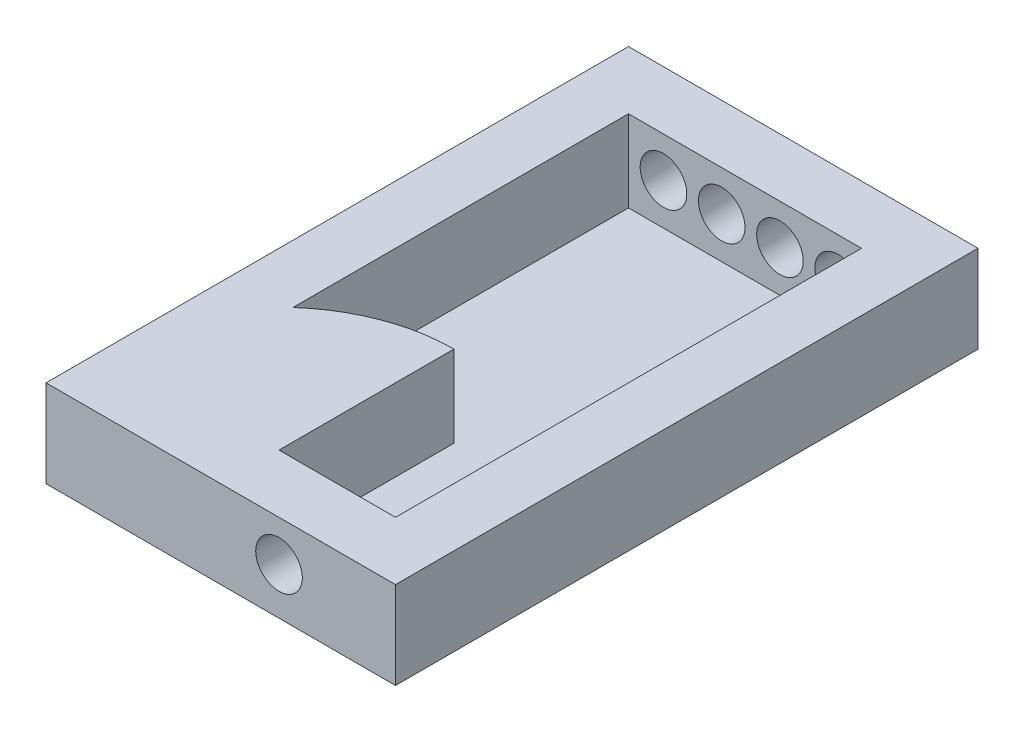
ISO-10303-21;
HEADER;
FILE_DESCRIPTION(('STEP AP214'),'2;1');
FILE_NAME('part.step','',(''),(''),'','','');
FILE_SCHEMA(('AUTOMOTIVE_DESIGN { 1 0 10303 214 1 1 1 1 }'));
ENDSEC;
DATA;
#1=APPLICATION_CONTEXT('core data for automotive mechanical design processes');
#2=APPLICATION_PROTOCOL_DEFINITION('international standard','automotive_design',2000,#1);
#3=PRODUCT_CONTEXT('',#1,'mechanical');
#4=PRODUCT('Part','Part','',(#3));
#5=PRODUCT_RELATED_PRODUCT_CATEGORY('part','',(#4));
#6=PRODUCT_DEFINITION_FORMATION('','',#4);
#7=PRODUCT_DEFINITION_CONTEXT('part definition',#1,'design');
#8=PRODUCT_DEFINITION('design','',#6,#7);
#9=PRODUCT_DEFINITION_SHAPE('','',#8);
#10=(LENGTH_UNIT() NAMED_UNIT(*) SI_UNIT(.MILLI.,.METRE.));
#11=(NAMED_UNIT(*) PLANE_ANGLE_UNIT() SI_UNIT($,.RADIAN.));
#12=(NAMED_UNIT(*) SI_UNIT($,.STERADIAN.) SOLID_ANGLE_UNIT());
#13=UNCERTAINTY_MEASURE_WITH_UNIT(LENGTH_MEASURE(1.E-05),#10,'distance_accuracy_value','');
#14=(GEOMETRIC_REPRESENTATION_CONTEXT(3) GLOBAL_UNCERTAINTY_ASSIGNED_CONTEXT((#13)) GLOBAL_UNIT_ASSIGNED_CONTEXT((#10,
#11,#12)) REPRESENTATION_CONTEXT('',''));
#15=CARTESIAN_POINT('',(0.,0.,0.));
#16=DIRECTION('',(0.,0.,1.));
#17=DIRECTION('',(1.,0.,0.));
#18=AXIS2_PLACEMENT_3D('',#15,#16,#17);
#19=CARTESIAN_POINT('',(-9.99999999999999,0.999999999999999,-9.99999999999999));
#20=DIRECTION('',(0.,0.,1.));
#21=DIRECTION('',(1.,0.,0.));
#22=AXIS2_PLACEMENT_3D('',#19,#20,#21);
#23=PLANE('',#22);
#24=CARTESIAN_POINT('',(-20.,8.,-9.99999999999999));
#25=DIRECTION('',(0.,0.,-1.));
#26=DIRECTION('',(-1.,0.,0.));
#27=AXIS2_PLACEMENT_3D('',#24,#25,#26);
#28=CIRCLE('',#27,4.);
#29=CARTESIAN_POINT('',(-24.,8.,-9.99999999999999));
#30=VERTEX_POINT('',#29);
#31=EDGE_CURVE('E269',#30,#30,#28,.T.);
#32=ORIENTED_EDGE('',*,*,#31,.F.);
#33=EDGE_LOOP('',(#32));
#34=FACE_BOUND('',#33,.T.);
#35=DIRECTION('',(0.,-1.,0.));
#36=VECTOR('',#35,1.);
#37=CARTESIAN_POINT('',(-30.,15.,-9.99999999999999));
#38=LINE('',#37,#36);
#39=CARTESIAN_POINT('',(-30.,15.,-9.99999999999999));
#40=VERTEX_POINT('',#39);
#41=CARTESIAN_POINT('',(-30.,0.999999999999999,-9.99999999999999));
#42=VERTEX_POINT('',#41);
#43=EDGE_CURVE('E122',#40,#42,#38,.T.);
#44=ORIENTED_EDGE('',*,*,#43,.F.);
#45=DIRECTION('',(1.,0.,0.));
#46=VECTOR('',#45,1.);
#47=CARTESIAN_POINT('',(-9.99999999999999,15.,-9.99999999999999));
#48=LINE('',#47,#46);
#49=CARTESIAN_POINT('',(-9.99999999999999,15.,-9.99999999999999));
#50=VERTEX_POINT('',#49);
#51=EDGE_CURVE('E133',#40,#50,#48,.T.);
#52=ORIENTED_EDGE('',*,*,#51,.T.);
#53=DIRECTION('',(0.,1.,0.));
#54=VECTOR('',#53,1.);
#55=CARTESIAN_POINT('',(-9.99999999999999,0.999999999999999,-9.99999999999999));
#56=LINE('',#55,#54);
#57=CARTESIAN_POINT('',(-9.99999999999999,0.999999999999999,-9.99999999999999));
#58=VERTEX_POINT('',#57);
#59=EDGE_CURVE('E158',#58,#50,#56,.T.);
#60=ORIENTED_EDGE('',*,*,#59,.F.);
#61=DIRECTION('',(1.,0.,0.));
#62=VECTOR('',#61,1.);
#63=CARTESIAN_POINT('',(-9.99999999999999,0.999999999999999,-9.99999999999999));
#64=LINE('',#63,#62);
#65=EDGE_CURVE('E135',#42,#58,#64,.T.);
#66=ORIENTED_EDGE('',*,*,#65,.F.);
#67=EDGE_LOOP('',(#44,#52,#60,#66));
#68=FACE_BOUND('',#67,.T.);
#69=ADVANCED_FACE('F39',(#34,#68),#23,.F.);
#70=CARTESIAN_POINT('',(-50.,0.999999999999999,-9.99999999999999));
#71=DIRECTION('',(-1.,0.,0.));
#72=DIRECTION('',(0.,0.,1.));
#73=AXIS2_PLACEMENT_3D('',#70,#71,#72);
#74=PLANE('',#73);
#75=DIRECTION('',(0.,-1.,0.));
#76=VECTOR('',#75,1.);
#77=CARTESIAN_POINT('',(-50.,15.,-32.399356808911));
#78=LINE('',#77,#76);
#79=CARTESIAN_POINT('',(-50.,15.,-32.399356808911));
#80=VERTEX_POINT('',#79);
#81=CARTESIAN_POINT('',(-50.,0.999999999999999,-32.399356808911));
#82=VERTEX_POINT('',#81);
#83=EDGE_CURVE('E313',#80,#82,#78,.T.);
#84=ORIENTED_EDGE('',*,*,#83,.T.);
#85=DIRECTION('',(0.,0.,1.));
#86=VECTOR('',#85,1.);
#87=CARTESIAN_POINT('',(-50.,0.999999999999999,-9.99999999999999));
#88=LINE('',#87,#86);
#89=CARTESIAN_POINT('',(-50.,0.999999999999999,-90.));
#90=VERTEX_POINT('',#89);
#91=EDGE_CURVE('E326',#90,#82,#88,.T.);
#92=ORIENTED_EDGE('',*,*,#91,.F.);
#93=DIRECTION('',(0.,1.,0.));
#94=VECTOR('',#93,1.);
#95=CARTESIAN_POINT('',(-50.,0.999999999999999,-90.));
#96=LINE('',#95,#94);
#97=CARTESIAN_POINT('',(-50.,15.,-90.));
#98=VERTEX_POINT('',#97);
#99=EDGE_CURVE('E162',#90,#98,#96,.T.);
#100=ORIENTED_EDGE('',*,*,#99,.T.);
#101=DIRECTION('',(0.,0.,1.));
#102=VECTOR('',#101,1.);
#103=CARTESIAN_POINT('',(-50.,15.,-9.99999999999999));
#104=LINE('',#103,#102);
#105=EDGE_CURVE('E146',#98,#80,#104,.T.);
#106=ORIENTED_EDGE('',*,*,#105,.T.);
#107=EDGE_LOOP('',(#84,#92,#100,#106));
#108=FACE_BOUND('',#107,.T.);
#109=ADVANCED_FACE('F232',(#108),#74,.F.);
#110=CARTESIAN_POINT('',(0.,15.,0.));
#111=DIRECTION('',(-1.,0.,0.));
#112=DIRECTION('',(0.,0.,1.));
#113=AXIS2_PLACEMENT_3D('',#110,#111,#112);
#114=PLANE('',#113);
#115=DIRECTION('',(0.,0.,-1.));
#116=VECTOR('',#115,1.);
#117=CARTESIAN_POINT('',(0.,0.,0.));
#118=LINE('',#117,#116);
#119=CARTESIAN_POINT('',(0.,0.,0.));
#120=VERTEX_POINT('',#119);
#121=CARTESIAN_POINT('',(0.,0.,-100.));
#122=VERTEX_POINT('',#121);
#123=EDGE_CURVE('E161',#120,#122,#118,.T.);
#124=ORIENTED_EDGE('',*,*,#123,.T.);
#125=DIRECTION('',(0.,-1.,0.));
#126=VECTOR('',#125,1.);
#127=CARTESIAN_POINT('',(0.,15.,-100.));
#128=LINE('',#127,#126);
#129=CARTESIAN_POINT('',(0.,15.,-100.));
#130=VERTEX_POINT('',#129);
#131=EDGE_CURVE('E11',#130,#122,#128,.T.);
#132=ORIENTED_EDGE('',*,*,#131,.F.);
#133=DIRECTION('',(0.,0.,-1.));
#134=VECTOR('',#133,1.);
#135=CARTESIAN_POINT('',(0.,15.,0.));
#136=LINE('',#135,#134);
#137=CARTESIAN_POINT('',(0.,15.,0.));
#138=VERTEX_POINT('',#137);
#139=EDGE_CURVE('E170',#138,#130,#136,.T.);
#140=ORIENTED_EDGE('',*,*,#139,.F.);
#141=DIRECTION('',(0.,-1.,0.));
#142=VECTOR('',#141,1.);
#143=CARTESIAN_POINT('',(0.,15.,0.));
#144=LINE('',#143,#142);
#145=EDGE_CURVE('E184',#138,#120,#144,.T.);
#146=ORIENTED_EDGE('',*,*,#145,.T.);
#147=EDGE_LOOP('',(#124,#132,#140,#146));
#148=FACE_BOUND('',#147,.T.);
#149=ADVANCED_FACE('F41',(#148),#114,.F.);
#150=CARTESIAN_POINT('',(0.,15.,-100.));
#151=DIRECTION('',(0.,0.,1.));
#152=DIRECTION('',(1.,0.,0.));
#153=AXIS2_PLACEMENT_3D('',#150,#151,#152);
#154=PLANE('',#153);
#155=CARTESIAN_POINT('',(-14.,8.09346836284162,-100.));
#156=DIRECTION('',(0.,0.,-1.));
#157=DIRECTION('',(-1.,0.,0.));
#158=AXIS2_PLACEMENT_3D('',#155,#156,#157);
#159=CIRCLE('',#158,4.);
#160=CARTESIAN_POINT('',(-18.,8.09346836284162,-100.));
#161=VERTEX_POINT('',#160);
#162=EDGE_CURVE('E288',#161,#161,#159,.T.);
#163=ORIENTED_EDGE('',*,*,#162,.F.);
#164=EDGE_LOOP('',(#163));
#165=FACE_BOUND('',#164,.T.);
#166=CARTESIAN_POINT('',(-24.,8.09346836284162,-100.));
#167=DIRECTION('',(0.,0.,-1.));
#168=DIRECTION('',(-1.,0.,0.));
#169=AXIS2_PLACEMENT_3D('',#166,#167,#168);
#170=CIRCLE('',#169,4.);
#171=CARTESIAN_POINT('',(-28.,8.09346836284162,-100.));
#172=VERTEX_POINT('',#171);
#173=EDGE_CURVE('E296',#172,#172,#170,.T.);
#174=ORIENTED_EDGE('',*,*,#173,.F.);
#175=EDGE_LOOP('',(#174));
#176=FACE_BOUND('',#175,.T.);
#177=CARTESIAN_POINT('',(-34.,8.09346836284162,-100.));
#178=DIRECTION('',(0.,0.,-1.));
#179=DIRECTION('',(-1.,0.,0.));
#180=AXIS2_PLACEMENT_3D('',#177,#178,#179);
#181=CIRCLE('',#180,4.00000000000001);
#182=CARTESIAN_POINT('',(-38.,8.09346836284162,-100.));
#183=VERTEX_POINT('',#182);
#184=EDGE_CURVE('E304',#183,#183,#181,.T.);
#185=ORIENTED_EDGE('',*,*,#184,.F.);
#186=EDGE_LOOP('',(#185));
#187=FACE_BOUND('',#186,.T.);
#188=CARTESIAN_POINT('',(-44.,8.09346836284162,-100.));
#189=DIRECTION('',(0.,0.,-1.));
#190=DIRECTION('',(-1.,0.,0.));
#191=AXIS2_PLACEMENT_3D('',#188,#189,#190);
#192=CIRCLE('',#191,4.);
#193=CARTESIAN_POINT('',(-48.,8.09346836284162,-100.));
#194=VERTEX_POINT('',#193);
#195=EDGE_CURVE('E268',#194,#194,#192,.T.);
#196=ORIENTED_EDGE('',*,*,#195,.F.);
#197=EDGE_LOOP('',(#196));
#198=FACE_BOUND('',#197,.T.);
#199=DIRECTION('',(-1.,0.,0.));
#200=VECTOR('',#199,1.);
#201=CARTESIAN_POINT('',(0.,0.,-100.));
#202=LINE('',#201,#200);
#203=CARTESIAN_POINT('',(-60.,0.,-100.));
#204=VERTEX_POINT('',#203);
#205=EDGE_CURVE('E188',#122,#204,#202,.T.);
#206=ORIENTED_EDGE('',*,*,#205,.T.);
#207=DIRECTION('',(0.,-1.,0.));
#208=VECTOR('',#207,1.);
#209=CARTESIAN_POINT('',(-60.,15.,-100.));
#210=LINE('',#209,#208);
#211=CARTESIAN_POINT('',(-60.,15.,-100.));
#212=VERTEX_POINT('',#211);
#213=EDGE_CURVE('E49',#212,#204,#210,.T.);
#214=ORIENTED_EDGE('',*,*,#213,.F.);
#215=DIRECTION('',(-1.,0.,0.));
#216=VECTOR('',#215,1.);
#217=CARTESIAN_POINT('',(0.,15.,-100.));
#218=LINE('',#217,#216);
#219=EDGE_CURVE('E174',#130,#212,#218,.T.);
#220=ORIENTED_EDGE('',*,*,#219,.F.);
#221=ORIENTED_EDGE('',*,*,#131,.T.);
#222=EDGE_LOOP('',(#206,#214,#220,#221));
#223=FACE_BOUND('',#222,.T.);
#224=ADVANCED_FACE('F223',(#165,#176,#187,#198,#223),#154,.F.);
#225=CARTESIAN_POINT('',(-60.,15.,0.));
#226=DIRECTION('',(1.,0.,0.));
#227=DIRECTION('',(0.,0.,-1.));
#228=AXIS2_PLACEMENT_3D('',#225,#226,#227);
#229=PLANE('',#228);
#230=CARTESIAN_POINT('',(-60.,7.89548794375605,-22.9721557431617));
#231=DIRECTION('',(-1.,0.,0.));
#232=DIRECTION('',(0.,0.,1.));
#233=AXIS2_PLACEMENT_3D('',#230,#231,#232);
#234=CIRCLE('',#233,5.);
#235=CARTESIAN_POINT('',(-60.,7.89548794375605,-17.9721557431617));
#236=VERTEX_POINT('',#235);
#237=EDGE_CURVE('E281',#236,#236,#234,.T.);
#238=ORIENTED_EDGE('',*,*,#237,.F.);
#239=EDGE_LOOP('',(#238));
#240=FACE_BOUND('',#239,.T.);
#241=DIRECTION('',(0.,0.,1.));
#242=VECTOR('',#241,1.);
#243=CARTESIAN_POINT('',(-60.,0.,0.));
#244=LINE('',#243,#242);
#245=CARTESIAN_POINT('',(-60.,0.,0.));
#246=VERTEX_POINT('',#245);
#247=EDGE_CURVE('E191',#204,#246,#244,.T.);
#248=ORIENTED_EDGE('',*,*,#247,.T.);
#249=DIRECTION('',(0.,-1.,0.));
#250=VECTOR('',#249,1.);
#251=CARTESIAN_POINT('',(-60.,15.,0.));
#252=LINE('',#251,#250);
#253=CARTESIAN_POINT('',(-60.,15.,0.));
#254=VERTEX_POINT('',#253);
#255=EDGE_CURVE('E199',#254,#246,#252,.T.);
#256=ORIENTED_EDGE('',*,*,#255,.F.);
#257=DIRECTION('',(0.,0.,1.));
#258=VECTOR('',#257,1.);
#259=CARTESIAN_POINT('',(-60.,15.,0.));
#260=LINE('',#259,#258);
#261=EDGE_CURVE('E178',#212,#254,#260,.T.);
#262=ORIENTED_EDGE('',*,*,#261,.F.);
#263=ORIENTED_EDGE('',*,*,#213,.T.);
#264=EDGE_LOOP('',(#248,#256,#262,#263));
#265=FACE_BOUND('',#264,.T.);
#266=ADVANCED_FACE('F209',(#240,#265),#229,.F.);
#267=CARTESIAN_POINT('',(0.,15.,0.));
#268=DIRECTION('',(0.,0.,-1.));
#269=DIRECTION('',(-1.,0.,0.));
#270=AXIS2_PLACEMENT_3D('',#267,#268,#269);
#271=PLANE('',#270);
#272=CARTESIAN_POINT('',(-20.,8.,0.));
#273=DIRECTION('',(0.,0.,-1.));
#274=DIRECTION('',(-1.,0.,0.));
#275=AXIS2_PLACEMENT_3D('',#272,#273,#274);
#276=CIRCLE('',#275,4.);
#277=CARTESIAN_POINT('',(-24.,8.,0.));
#278=VERTEX_POINT('',#277);
#279=EDGE_CURVE('E43',#278,#278,#276,.T.);
#280=ORIENTED_EDGE('',*,*,#279,.T.);
#281=EDGE_LOOP('',(#280));
#282=FACE_BOUND('',#281,.T.);
#283=DIRECTION('',(1.,0.,0.));
#284=VECTOR('',#283,1.);
#285=CARTESIAN_POINT('',(0.,0.,0.));
#286=LINE('',#285,#284);
#287=EDGE_CURVE('E175',#246,#120,#286,.T.);
#288=ORIENTED_EDGE('',*,*,#287,.T.);
#289=ORIENTED_EDGE('',*,*,#145,.F.);
#290=DIRECTION('',(1.,0.,0.));
#291=VECTOR('',#290,1.);
#292=CARTESIAN_POINT('',(0.,15.,0.));
#293=LINE('',#292,#291);
#294=EDGE_CURVE('E181',#254,#138,#293,.T.);
#295=ORIENTED_EDGE('',*,*,#294,.F.);
#296=ORIENTED_EDGE('',*,*,#255,.T.);
#297=EDGE_LOOP('',(#288,#289,#295,#296));
#298=FACE_BOUND('',#297,.T.);
#299=ADVANCED_FACE('F218',(#282,#298),#271,.F.);
#300=CARTESIAN_POINT('',(0.,15.,0.));
#301=DIRECTION('',(0.,1.,0.));
#302=DIRECTION('',(0.,0.,1.));
#303=AXIS2_PLACEMENT_3D('',#300,#301,#302);
#304=PLANE('',#303);
#305=ORIENTED_EDGE('',*,*,#51,.F.);
#306=DIRECTION('',(0.,0.,-1.));
#307=VECTOR('',#306,1.);
#308=CARTESIAN_POINT('',(-30.,15.,-9.99999999999999));
#309=LINE('',#308,#307);
#310=CARTESIAN_POINT('',(-30.,15.,-40.0288392291961));
#311=VERTEX_POINT('',#310);
#312=EDGE_CURVE('E119',#40,#311,#309,.T.);
#313=ORIENTED_EDGE('',*,*,#312,.T.);
#314=CARTESIAN_POINT('',(-30.,15.,-9.99999999999999));
#315=DIRECTION('',(0.,1.,0.));
#316=DIRECTION('',(0.,0.,1.));
#317=AXIS2_PLACEMENT_3D('',#314,#315,#316);
#318=CIRCLE('',#317,30.0288392291961);
#319=EDGE_CURVE('E127',#311,#80,#318,.T.);
#320=ORIENTED_EDGE('',*,*,#319,.T.);
#321=ORIENTED_EDGE('',*,*,#105,.F.);
#322=DIRECTION('',(-1.,0.,0.));
#323=VECTOR('',#322,1.);
#324=CARTESIAN_POINT('',(-9.99999999999999,15.,-90.));
#325=LINE('',#324,#323);
#326=CARTESIAN_POINT('',(-9.99999999999999,15.,-90.));
#327=VERTEX_POINT('',#326);
#328=EDGE_CURVE('E154',#327,#98,#325,.T.);
#329=ORIENTED_EDGE('',*,*,#328,.F.);
#330=DIRECTION('',(0.,0.,-1.));
#331=VECTOR('',#330,1.);
#332=CARTESIAN_POINT('',(-9.99999999999999,15.,-9.99999999999999));
#333=LINE('',#332,#331);
#334=EDGE_CURVE('E137',#50,#327,#333,.T.);
#335=ORIENTED_EDGE('',*,*,#334,.F.);
#336=EDGE_LOOP('',(#305,#313,#320,#321,#329,#335));
#337=FACE_BOUND('',#336,.T.);
#338=ORIENTED_EDGE('',*,*,#139,.T.);
#339=ORIENTED_EDGE('',*,*,#219,.T.);
#340=ORIENTED_EDGE('',*,*,#261,.T.);
#341=ORIENTED_EDGE('',*,*,#294,.T.);
#342=EDGE_LOOP('',(#338,#339,#340,#341));
#343=FACE_BOUND('',#342,.T.);
#344=ADVANCED_FACE('F140',(#337,#343),#304,.T.);
#345=CARTESIAN_POINT('',(0.,0.,0.));
#346=DIRECTION('',(0.,1.,0.));
#347=DIRECTION('',(0.,0.,1.));
#348=AXIS2_PLACEMENT_3D('',#345,#346,#347);
#349=PLANE('',#348);
#350=ORIENTED_EDGE('',*,*,#123,.F.);
#351=ORIENTED_EDGE('',*,*,#287,.F.);
#352=ORIENTED_EDGE('',*,*,#247,.F.);
#353=ORIENTED_EDGE('',*,*,#205,.F.);
#354=EDGE_LOOP('',(#350,#351,#352,#353));
#355=FACE_BOUND('',#354,.T.);
#356=ADVANCED_FACE('F215',(#355),#349,.F.);
#357=CARTESIAN_POINT('',(-9.99999999999999,0.999999999999999,-9.99999999999999));
#358=DIRECTION('',(1.,0.,0.));
#359=DIRECTION('',(0.,0.,-1.));
#360=AXIS2_PLACEMENT_3D('',#357,#358,#359);
#361=PLANE('',#360);
#362=ORIENTED_EDGE('',*,*,#334,.T.);
#363=DIRECTION('',(0.,1.,0.));
#364=VECTOR('',#363,1.);
#365=CARTESIAN_POINT('',(-9.99999999999999,0.999999999999999,-90.));
#366=LINE('',#365,#364);
#367=CARTESIAN_POINT('',(-9.99999999999999,8.09346836284162,-90.));
#368=VERTEX_POINT('',#367);
#369=EDGE_CURVE('E169',#368,#327,#366,.T.);
#370=ORIENTED_EDGE('',*,*,#369,.F.);
#371=CARTESIAN_POINT('',(-9.99999999999999,0.999999999999999,-90.));
#372=VERTEX_POINT('',#371);
#373=EDGE_CURVE('E165',#372,#368,#366,.T.);
#374=ORIENTED_EDGE('',*,*,#373,.F.);
#375=DIRECTION('',(0.,0.,-1.));
#376=VECTOR('',#375,1.);
#377=CARTESIAN_POINT('',(-9.99999999999999,0.999999999999999,-9.99999999999999));
#378=LINE('',#377,#376);
#379=EDGE_CURVE('E145',#58,#372,#378,.T.);
#380=ORIENTED_EDGE('',*,*,#379,.F.);
#381=ORIENTED_EDGE('',*,*,#59,.T.);
#382=EDGE_LOOP('',(#362,#370,#374,#380,#381));
#383=FACE_BOUND('',#382,.T.);
#384=ADVANCED_FACE('F251',(#383),#361,.F.);
#385=CARTESIAN_POINT('',(-9.99999999999999,0.999999999999999,-90.));
#386=DIRECTION('',(0.,0.,-1.));
#387=DIRECTION('',(-1.,0.,0.));
#388=AXIS2_PLACEMENT_3D('',#385,#386,#387);
#389=PLANE('',#388);
#390=CARTESIAN_POINT('',(-24.,8.09346836284162,-90.));
#391=DIRECTION('',(0.,0.,-1.));
#392=DIRECTION('',(-1.,0.,0.));
#393=AXIS2_PLACEMENT_3D('',#390,#391,#392);
#394=CIRCLE('',#393,4.);
#395=CARTESIAN_POINT('',(-28.,8.09346836284162,-90.));
#396=VERTEX_POINT('',#395);
#397=EDGE_CURVE('E292',#396,#396,#394,.T.);
#398=ORIENTED_EDGE('',*,*,#397,.T.);
#399=EDGE_LOOP('',(#398));
#400=FACE_BOUND('',#399,.T.);
#401=CARTESIAN_POINT('',(-34.,8.09346836284162,-90.));
#402=DIRECTION('',(0.,0.,-1.));
#403=DIRECTION('',(-1.,0.,0.));
#404=AXIS2_PLACEMENT_3D('',#401,#402,#403);
#405=CIRCLE('',#404,4.00000000000001);
#406=CARTESIAN_POINT('',(-38.,8.09346836284162,-90.));
#407=VERTEX_POINT('',#406);
#408=EDGE_CURVE('E300',#407,#407,#405,.T.);
#409=ORIENTED_EDGE('',*,*,#408,.T.);
#410=EDGE_LOOP('',(#409));
#411=FACE_BOUND('',#410,.T.);
#412=CARTESIAN_POINT('',(-44.,8.09346836284162,-90.));
#413=DIRECTION('',(0.,0.,-1.));
#414=DIRECTION('',(-1.,0.,0.));
#415=AXIS2_PLACEMENT_3D('',#412,#413,#414);
#416=CIRCLE('',#415,4.);
#417=CARTESIAN_POINT('',(-48.,8.09346836284162,-90.));
#418=VERTEX_POINT('',#417);
#419=EDGE_CURVE('E273',#418,#418,#416,.T.);
#420=ORIENTED_EDGE('',*,*,#419,.T.);
#421=EDGE_LOOP('',(#420));
#422=FACE_BOUND('',#421,.T.);
#423=ORIENTED_EDGE('',*,*,#373,.T.);
#424=CARTESIAN_POINT('',(-14.,8.09346836284162,-90.));
#425=DIRECTION('',(0.,0.,-1.));
#426=DIRECTION('',(-1.,0.,0.));
#427=AXIS2_PLACEMENT_3D('',#424,#425,#426);
#428=CIRCLE('',#427,4.);
#429=EDGE_CURVE('E54',#368,#368,#428,.T.);
#430=ORIENTED_EDGE('',*,*,#429,.T.);
#431=ORIENTED_EDGE('',*,*,#369,.T.);
#432=ORIENTED_EDGE('',*,*,#328,.T.);
#433=ORIENTED_EDGE('',*,*,#99,.F.);
#434=DIRECTION('',(-1.,0.,0.));
#435=VECTOR('',#434,1.);
#436=CARTESIAN_POINT('',(-9.99999999999999,0.999999999999999,-90.));
#437=LINE('',#436,#435);
#438=EDGE_CURVE('E151',#372,#90,#437,.T.);
#439=ORIENTED_EDGE('',*,*,#438,.F.);
#440=EDGE_LOOP('',(#423,#430,#431,#432,#433,#439));
#441=FACE_BOUND('',#440,.T.);
#442=ADVANCED_FACE('F248',(#400,#411,#422,#441),#389,.F.);
#443=CARTESIAN_POINT('',(0.,0.999999999999999,0.));
#444=DIRECTION('',(0.,1.,0.));
#445=DIRECTION('',(0.,0.,1.));
#446=AXIS2_PLACEMENT_3D('',#443,#444,#445);
#447=PLANE('',#446);
#448=CARTESIAN_POINT('',(-30.,0.999999999999999,-9.99999999999999));
#449=DIRECTION('',(0.,1.,0.));
#450=DIRECTION('',(0.,0.,1.));
#451=AXIS2_PLACEMENT_3D('',#448,#449,#450);
#452=CIRCLE('',#451,30.0288392291961);
#453=CARTESIAN_POINT('',(-30.,0.999999999999999,-40.0288392291961));
#454=VERTEX_POINT('',#453);
#455=EDGE_CURVE('E128',#454,#82,#452,.T.);
#456=ORIENTED_EDGE('',*,*,#455,.F.);
#457=DIRECTION('',(0.,0.,-1.));
#458=VECTOR('',#457,1.);
#459=CARTESIAN_POINT('',(-30.,0.999999999999999,-9.99999999999999));
#460=LINE('',#459,#458);
#461=EDGE_CURVE('E287',#42,#454,#460,.T.);
#462=ORIENTED_EDGE('',*,*,#461,.F.);
#463=ORIENTED_EDGE('',*,*,#65,.T.);
#464=ORIENTED_EDGE('',*,*,#379,.T.);
#465=ORIENTED_EDGE('',*,*,#438,.T.);
#466=ORIENTED_EDGE('',*,*,#91,.T.);
#467=EDGE_LOOP('',(#456,#462,#463,#464,#465,#466));
#468=FACE_BOUND('',#467,.T.);
#469=ADVANCED_FACE('F245',(#468),#447,.T.);
#470=CARTESIAN_POINT('',(-30.,15.,-9.99999999999999));
#471=DIRECTION('',(-1.,0.,0.));
#472=DIRECTION('',(0.,0.,1.));
#473=AXIS2_PLACEMENT_3D('',#470,#471,#472);
#474=PLANE('',#473);
#475=ORIENTED_EDGE('',*,*,#461,.T.);
#476=DIRECTION('',(0.,-1.,0.));
#477=VECTOR('',#476,1.);
#478=CARTESIAN_POINT('',(-30.,15.,-40.0288392291961));
#479=LINE('',#478,#477);
#480=EDGE_CURVE('E61',#311,#454,#479,.T.);
#481=ORIENTED_EDGE('',*,*,#480,.F.);
#482=ORIENTED_EDGE('',*,*,#312,.F.);
#483=ORIENTED_EDGE('',*,*,#43,.T.);
#484=EDGE_LOOP('',(#475,#481,#482,#483));
#485=FACE_BOUND('',#484,.T.);
#486=ADVANCED_FACE('F121',(#485),#474,.F.);
#487=CARTESIAN_POINT('',(-30.,15.,-9.99999999999999));
#488=DIRECTION('',(0.,-1.,0.));
#489=DIRECTION('',(0.,0.,-1.));
#490=AXIS2_PLACEMENT_3D('',#487,#488,#489);
#491=CYLINDRICAL_SURFACE('',#490,30.0288392291961);
#492=ORIENTED_EDGE('',*,*,#455,.T.);
#493=ORIENTED_EDGE('',*,*,#83,.F.);
#494=ORIENTED_EDGE('',*,*,#319,.F.);
#495=ORIENTED_EDGE('',*,*,#480,.T.);
#496=EDGE_LOOP('',(#492,#493,#494,#495));
#497=FACE_BOUND('',#496,.T.);
#498=ADVANCED_FACE('F345',(#497),#491,.T.);
#499=CARTESIAN_POINT('',(-44.,8.09346836284162,-90.));
#500=DIRECTION('',(0.,0.,-1.));
#501=DIRECTION('',(-1.,0.,0.));
#502=AXIS2_PLACEMENT_3D('',#499,#500,#501);
#503=CYLINDRICAL_SURFACE('',#502,4.);
#504=ORIENTED_EDGE('',*,*,#419,.F.);
#505=EDGE_LOOP('',(#504));
#506=FACE_BOUND('',#505,.T.);
#507=ORIENTED_EDGE('',*,*,#195,.T.);
#508=EDGE_LOOP('',(#507));
#509=FACE_BOUND('',#508,.T.);
#510=ADVANCED_FACE('F347',(#506,#509),#503,.F.);
#511=CARTESIAN_POINT('',(-34.,8.09346836284162,-90.));
#512=DIRECTION('',(0.,0.,-1.));
#513=DIRECTION('',(-1.,0.,0.));
#514=AXIS2_PLACEMENT_3D('',#511,#512,#513);
#515=CYLINDRICAL_SURFACE('',#514,4.00000000000001);
#516=ORIENTED_EDGE('',*,*,#408,.F.);
#517=EDGE_LOOP('',(#516));
#518=FACE_BOUND('',#517,.T.);
#519=ORIENTED_EDGE('',*,*,#184,.T.);
#520=EDGE_LOOP('',(#519));
#521=FACE_BOUND('',#520,.T.);
#522=ADVANCED_FACE('F353',(#518,#521),#515,.F.);
#523=CARTESIAN_POINT('',(-24.,8.09346836284162,-90.));
#524=DIRECTION('',(0.,0.,-1.));
#525=DIRECTION('',(-1.,0.,0.));
#526=AXIS2_PLACEMENT_3D('',#523,#524,#525);
#527=CYLINDRICAL_SURFACE('',#526,4.);
#528=ORIENTED_EDGE('',*,*,#397,.F.);
#529=EDGE_LOOP('',(#528));
#530=FACE_BOUND('',#529,.T.);
#531=ORIENTED_EDGE('',*,*,#173,.T.);
#532=EDGE_LOOP('',(#531));
#533=FACE_BOUND('',#532,.T.);
#534=ADVANCED_FACE('F359',(#530,#533),#527,.F.);
#535=CARTESIAN_POINT('',(-14.,8.09346836284162,-90.));
#536=DIRECTION('',(0.,0.,-1.));
#537=DIRECTION('',(-1.,0.,0.));
#538=AXIS2_PLACEMENT_3D('',#535,#536,#537);
#539=CYLINDRICAL_SURFACE('',#538,4.);
#540=ORIENTED_EDGE('',*,*,#429,.F.);
#541=EDGE_LOOP('',(#540));
#542=FACE_BOUND('',#541,.T.);
#543=ORIENTED_EDGE('',*,*,#162,.T.);
#544=EDGE_LOOP('',(#543));
#545=FACE_BOUND('',#544,.T.);
#546=ADVANCED_FACE('F363',(#542,#545),#539,.F.);
#547=CARTESIAN_POINT('',(-20.,8.,1.00000000000001));
#548=DIRECTION('',(0.,0.,-1.));
#549=DIRECTION('',(-1.,0.,0.));
#550=AXIS2_PLACEMENT_3D('',#547,#548,#549);
#551=CYLINDRICAL_SURFACE('',#550,4.);
#552=ORIENTED_EDGE('',*,*,#31,.T.);
#553=EDGE_LOOP('',(#552));
#554=FACE_BOUND('',#553,.T.);
#555=ORIENTED_EDGE('',*,*,#279,.F.);
#556=EDGE_LOOP('',(#555));
#557=FACE_BOUND('',#556,.T.);
#558=ADVANCED_FACE('F367',(#554,#557),#551,.F.);
#559=CARTESIAN_POINT('',(-32.,7.89548794375605,-22.9721557431617));
#560=DIRECTION('',(-1.,0.,0.));
#561=DIRECTION('',(0.,0.,1.));
#562=AXIS2_PLACEMENT_3D('',#559,#560,#561);
#563=CYLINDRICAL_SURFACE('',#562,5.);
#564=CARTESIAN_POINT('',(-32.,7.89548794375605,-22.9721557431617));
#565=DIRECTION('',(-1.,0.,0.));
#566=DIRECTION('',(0.,0.,1.));
#567=AXIS2_PLACEMENT_3D('',#564,#565,#566);
#568=CIRCLE('',#567,5.);
#569=CARTESIAN_POINT('',(-32.,7.89548794375605,-17.9721557431617));
#570=VERTEX_POINT('',#569);
#571=EDGE_CURVE('E276',#570,#570,#568,.T.);
#572=ORIENTED_EDGE('',*,*,#571,.F.);
#573=EDGE_LOOP('',(#572));
#574=FACE_BOUND('',#573,.T.);
#575=ORIENTED_EDGE('',*,*,#237,.T.);
#576=EDGE_LOOP('',(#575));
#577=FACE_BOUND('',#576,.T.);
#578=ADVANCED_FACE('F370',(#574,#577),#563,.F.);
#579=CARTESIAN_POINT('',(-32.,7.89548794375605,-22.9721557431617));
#580=DIRECTION('',(-1.,0.,0.));
#581=DIRECTION('',(0.,0.,1.));
#582=AXIS2_PLACEMENT_3D('',#579,#580,#581);
#583=PLANE('',#582);
#584=ORIENTED_EDGE('',*,*,#571,.T.);
#585=EDGE_LOOP('',(#584));
#586=FACE_BOUND('',#585,.T.);
#587=ADVANCED_FACE('F373',(#586),#583,.T.);
#588=CLOSED_SHELL('',(#69,#109,#149,#224,#266,#299,#344,#356,#384,#442,#469,#486,#498,#510,#522,
#534,#546,#558,#578,#587));
#589=MANIFOLD_SOLID_BREP('B2',#588);
#590=ADVANCED_BREP_SHAPE_REPRESENTATION('',(#18,#589),#14);
#591=SHAPE_DEFINITION_REPRESENTATION(#9,#590);
ENDSEC;
END-ISO-10303-21;
